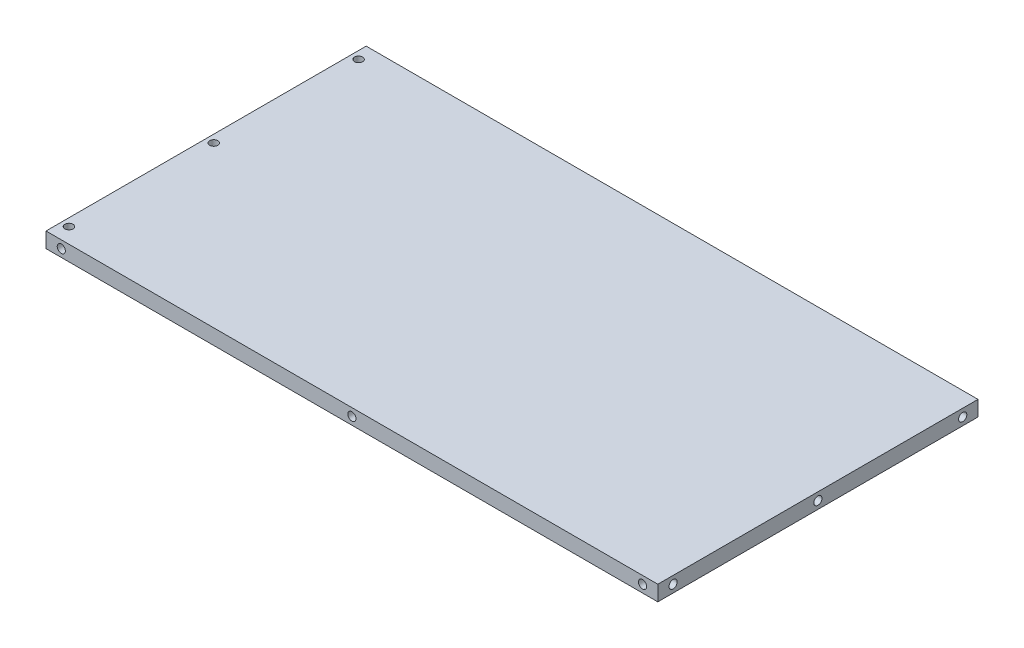
ISO-10303-21;
HEADER;
FILE_DESCRIPTION(('STEP AP214'),'2;1');
FILE_NAME('part.step','',(''),(''),'','','');
FILE_SCHEMA(('AUTOMOTIVE_DESIGN { 1 0 10303 214 1 1 1 1 }'));
ENDSEC;
DATA;
#1=APPLICATION_CONTEXT('core data for automotive mechanical design processes');
#2=APPLICATION_PROTOCOL_DEFINITION('international standard','automotive_design',2000,#1);
#3=PRODUCT_CONTEXT('',#1,'mechanical');
#4=PRODUCT('Part','Part','',(#3));
#5=PRODUCT_RELATED_PRODUCT_CATEGORY('part','',(#4));
#6=PRODUCT_DEFINITION_FORMATION('','',#4);
#7=PRODUCT_DEFINITION_CONTEXT('part definition',#1,'design');
#8=PRODUCT_DEFINITION('design','',#6,#7);
#9=PRODUCT_DEFINITION_SHAPE('','',#8);
#10=(LENGTH_UNIT() NAMED_UNIT(*) SI_UNIT(.MILLI.,.METRE.));
#11=(NAMED_UNIT(*) PLANE_ANGLE_UNIT() SI_UNIT($,.RADIAN.));
#12=(NAMED_UNIT(*) SI_UNIT($,.STERADIAN.) SOLID_ANGLE_UNIT());
#13=UNCERTAINTY_MEASURE_WITH_UNIT(LENGTH_MEASURE(1.E-05),#10,'distance_accuracy_value','');
#14=(GEOMETRIC_REPRESENTATION_CONTEXT(3) GLOBAL_UNCERTAINTY_ASSIGNED_CONTEXT((#13)) GLOBAL_UNIT_ASSIGNED_CONTEXT((#10,
#11,#12)) REPRESENTATION_CONTEXT('',''));
#15=CARTESIAN_POINT('',(0.,0.,0.));
#16=DIRECTION('',(0.,0.,1.));
#17=DIRECTION('',(1.,0.,0.));
#18=AXIS2_PLACEMENT_3D('',#15,#16,#17);
#19=CARTESIAN_POINT('',(300.,15.,157.));
#20=DIRECTION('',(-1.,0.,0.));
#21=DIRECTION('',(0.,0.,1.));
#22=AXIS2_PLACEMENT_3D('',#19,#20,#21);
#23=PLANE('',#22);
#24=CARTESIAN_POINT('',(300.,7.5,-142.));
#25=DIRECTION('',(1.,0.,0.));
#26=DIRECTION('',(0.,0.,-1.));
#27=AXIS2_PLACEMENT_3D('',#24,#25,#26);
#28=CIRCLE('',#27,3.99999999999999);
#29=CARTESIAN_POINT('',(300.,7.5,-146.));
#30=VERTEX_POINT('',#29);
#31=EDGE_CURVE('E166',#30,#30,#28,.T.);
#32=ORIENTED_EDGE('',*,*,#31,.F.);
#33=EDGE_LOOP('',(#32));
#34=FACE_BOUND('',#33,.T.);
#35=CARTESIAN_POINT('',(300.,7.5,0.));
#36=DIRECTION('',(1.,0.,0.));
#37=DIRECTION('',(0.,0.,-1.));
#38=AXIS2_PLACEMENT_3D('',#35,#36,#37);
#39=CIRCLE('',#38,3.99999999999999);
#40=CARTESIAN_POINT('',(300.,7.5,-4.00000000000002));
#41=VERTEX_POINT('',#40);
#42=EDGE_CURVE('E160',#41,#41,#39,.T.);
#43=ORIENTED_EDGE('',*,*,#42,.F.);
#44=EDGE_LOOP('',(#43));
#45=FACE_BOUND('',#44,.T.);
#46=CARTESIAN_POINT('',(300.,7.5,142.));
#47=DIRECTION('',(1.,0.,0.));
#48=DIRECTION('',(0.,0.,-1.));
#49=AXIS2_PLACEMENT_3D('',#46,#47,#48);
#50=CIRCLE('',#49,3.99999999999999);
#51=CARTESIAN_POINT('',(300.,7.5,138.));
#52=VERTEX_POINT('',#51);
#53=EDGE_CURVE('E152',#52,#52,#50,.T.);
#54=ORIENTED_EDGE('',*,*,#53,.F.);
#55=EDGE_LOOP('',(#54));
#56=FACE_BOUND('',#55,.T.);
#57=DIRECTION('',(0.,0.,-1.));
#58=VECTOR('',#57,1.);
#59=CARTESIAN_POINT('',(300.,0.,157.));
#60=LINE('',#59,#58);
#61=CARTESIAN_POINT('',(300.,0.,157.));
#62=VERTEX_POINT('',#61);
#63=CARTESIAN_POINT('',(300.,0.,-157.));
#64=VERTEX_POINT('',#63);
#65=EDGE_CURVE('E102',#62,#64,#60,.T.);
#66=ORIENTED_EDGE('',*,*,#65,.T.);
#67=DIRECTION('',(0.,-1.,0.));
#68=VECTOR('',#67,1.);
#69=CARTESIAN_POINT('',(300.,15.,-157.));
#70=LINE('',#69,#68);
#71=CARTESIAN_POINT('',(300.,15.,-157.));
#72=VERTEX_POINT('',#71);
#73=EDGE_CURVE('E11',#72,#64,#70,.T.);
#74=ORIENTED_EDGE('',*,*,#73,.F.);
#75=DIRECTION('',(0.,0.,-1.));
#76=VECTOR('',#75,1.);
#77=CARTESIAN_POINT('',(300.,15.,157.));
#78=LINE('',#77,#76);
#79=CARTESIAN_POINT('',(300.,15.,157.));
#80=VERTEX_POINT('',#79);
#81=EDGE_CURVE('E90',#80,#72,#78,.T.);
#82=ORIENTED_EDGE('',*,*,#81,.F.);
#83=DIRECTION('',(0.,-1.,0.));
#84=VECTOR('',#83,1.);
#85=CARTESIAN_POINT('',(300.,15.,157.));
#86=LINE('',#85,#84);
#87=EDGE_CURVE('E98',#80,#62,#86,.T.);
#88=ORIENTED_EDGE('',*,*,#87,.T.);
#89=EDGE_LOOP('',(#66,#74,#82,#88));
#90=FACE_BOUND('',#89,.T.);
#91=ADVANCED_FACE('F39',(#34,#45,#56,#90),#23,.F.);
#92=CARTESIAN_POINT('',(-300.,15.,-157.));
#93=DIRECTION('',(0.,0.,1.));
#94=DIRECTION('',(1.,0.,0.));
#95=AXIS2_PLACEMENT_3D('',#92,#93,#94);
#96=PLANE('',#95);
#97=CARTESIAN_POINT('',(0.,7.5,-157.));
#98=DIRECTION('',(0.,0.,1.));
#99=DIRECTION('',(1.,0.,0.));
#100=AXIS2_PLACEMENT_3D('',#97,#98,#99);
#101=CIRCLE('',#100,3.99999999999999);
#102=CARTESIAN_POINT('',(3.99999999999994,7.5,-157.));
#103=VERTEX_POINT('',#102);
#104=EDGE_CURVE('E182',#103,#103,#101,.T.);
#105=ORIENTED_EDGE('',*,*,#104,.T.);
#106=EDGE_LOOP('',(#105));
#107=FACE_BOUND('',#106,.T.);
#108=CARTESIAN_POINT('',(285.,7.5,-157.));
#109=DIRECTION('',(0.,0.,1.));
#110=DIRECTION('',(1.,0.,0.));
#111=AXIS2_PLACEMENT_3D('',#108,#109,#110);
#112=CIRCLE('',#111,3.99999999999999);
#113=CARTESIAN_POINT('',(289.,7.5,-157.));
#114=VERTEX_POINT('',#113);
#115=EDGE_CURVE('E176',#114,#114,#112,.T.);
#116=ORIENTED_EDGE('',*,*,#115,.T.);
#117=EDGE_LOOP('',(#116));
#118=FACE_BOUND('',#117,.T.);
#119=CARTESIAN_POINT('',(-285.,7.5,-157.));
#120=DIRECTION('',(0.,0.,1.));
#121=DIRECTION('',(1.,0.,0.));
#122=AXIS2_PLACEMENT_3D('',#119,#120,#121);
#123=CIRCLE('',#122,3.99999999999999);
#124=CARTESIAN_POINT('',(-281.,7.5,-157.));
#125=VERTEX_POINT('',#124);
#126=EDGE_CURVE('E170',#125,#125,#123,.T.);
#127=ORIENTED_EDGE('',*,*,#126,.T.);
#128=EDGE_LOOP('',(#127));
#129=FACE_BOUND('',#128,.T.);
#130=DIRECTION('',(-1.,0.,0.));
#131=VECTOR('',#130,1.);
#132=CARTESIAN_POINT('',(-300.,0.,-157.));
#133=LINE('',#132,#131);
#134=CARTESIAN_POINT('',(-300.,0.,-157.));
#135=VERTEX_POINT('',#134);
#136=EDGE_CURVE('E94',#64,#135,#133,.T.);
#137=ORIENTED_EDGE('',*,*,#136,.T.);
#138=DIRECTION('',(0.,-1.,0.));
#139=VECTOR('',#138,1.);
#140=CARTESIAN_POINT('',(-300.,15.,-157.));
#141=LINE('',#140,#139);
#142=CARTESIAN_POINT('',(-300.,15.,-157.));
#143=VERTEX_POINT('',#142);
#144=EDGE_CURVE('E47',#143,#135,#141,.T.);
#145=ORIENTED_EDGE('',*,*,#144,.F.);
#146=DIRECTION('',(-1.,0.,0.));
#147=VECTOR('',#146,1.);
#148=CARTESIAN_POINT('',(-300.,15.,-157.));
#149=LINE('',#148,#147);
#150=EDGE_CURVE('E85',#72,#143,#149,.T.);
#151=ORIENTED_EDGE('',*,*,#150,.F.);
#152=ORIENTED_EDGE('',*,*,#73,.T.);
#153=EDGE_LOOP('',(#137,#145,#151,#152));
#154=FACE_BOUND('',#153,.T.);
#155=ADVANCED_FACE('F93',(#107,#118,#129,#154),#96,.F.);
#156=CARTESIAN_POINT('',(-300.,15.,157.));
#157=DIRECTION('',(1.,0.,0.));
#158=DIRECTION('',(0.,0.,-1.));
#159=AXIS2_PLACEMENT_3D('',#156,#157,#158);
#160=PLANE('',#159);
#161=DIRECTION('',(0.,0.,1.));
#162=VECTOR('',#161,1.);
#163=CARTESIAN_POINT('',(-300.,0.,157.));
#164=LINE('',#163,#162);
#165=CARTESIAN_POINT('',(-300.,0.,157.));
#166=VERTEX_POINT('',#165);
#167=EDGE_CURVE('E72',#135,#166,#164,.T.);
#168=ORIENTED_EDGE('',*,*,#167,.T.);
#169=DIRECTION('',(0.,-1.,0.));
#170=VECTOR('',#169,1.);
#171=CARTESIAN_POINT('',(-300.,15.,157.));
#172=LINE('',#171,#170);
#173=CARTESIAN_POINT('',(-300.,15.,157.));
#174=VERTEX_POINT('',#173);
#175=EDGE_CURVE('E95',#174,#166,#172,.T.);
#176=ORIENTED_EDGE('',*,*,#175,.F.);
#177=DIRECTION('',(0.,0.,1.));
#178=VECTOR('',#177,1.);
#179=CARTESIAN_POINT('',(-300.,15.,157.));
#180=LINE('',#179,#178);
#181=EDGE_CURVE('E88',#143,#174,#180,.T.);
#182=ORIENTED_EDGE('',*,*,#181,.F.);
#183=ORIENTED_EDGE('',*,*,#144,.T.);
#184=EDGE_LOOP('',(#168,#176,#182,#183));
#185=FACE_BOUND('',#184,.T.);
#186=ADVANCED_FACE('F96',(#185),#160,.F.);
#187=CARTESIAN_POINT('',(-300.,15.,157.));
#188=DIRECTION('',(0.,0.,-1.));
#189=DIRECTION('',(-1.,0.,0.));
#190=AXIS2_PLACEMENT_3D('',#187,#188,#189);
#191=PLANE('',#190);
#192=CARTESIAN_POINT('',(285.,7.5,157.));
#193=DIRECTION('',(0.,0.,1.));
#194=DIRECTION('',(1.,0.,0.));
#195=AXIS2_PLACEMENT_3D('',#192,#193,#194);
#196=CIRCLE('',#195,3.99999999999999);
#197=CARTESIAN_POINT('',(289.,7.5,157.));
#198=VERTEX_POINT('',#197);
#199=EDGE_CURVE('E148',#198,#198,#196,.T.);
#200=ORIENTED_EDGE('',*,*,#199,.F.);
#201=EDGE_LOOP('',(#200));
#202=FACE_BOUND('',#201,.T.);
#203=CARTESIAN_POINT('',(0.,7.5,157.));
#204=DIRECTION('',(0.,0.,1.));
#205=DIRECTION('',(1.,0.,0.));
#206=AXIS2_PLACEMENT_3D('',#203,#204,#205);
#207=CIRCLE('',#206,3.99999999999999);
#208=CARTESIAN_POINT('',(3.99999999999994,7.5,157.));
#209=VERTEX_POINT('',#208);
#210=EDGE_CURVE('E142',#209,#209,#207,.T.);
#211=ORIENTED_EDGE('',*,*,#210,.F.);
#212=EDGE_LOOP('',(#211));
#213=FACE_BOUND('',#212,.T.);
#214=CARTESIAN_POINT('',(-285.,7.5,157.));
#215=DIRECTION('',(0.,0.,1.));
#216=DIRECTION('',(1.,0.,0.));
#217=AXIS2_PLACEMENT_3D('',#214,#215,#216);
#218=CIRCLE('',#217,3.99999999999999);
#219=CARTESIAN_POINT('',(-281.,7.5,157.));
#220=VERTEX_POINT('',#219);
#221=EDGE_CURVE('E134',#220,#220,#218,.T.);
#222=ORIENTED_EDGE('',*,*,#221,.F.);
#223=EDGE_LOOP('',(#222));
#224=FACE_BOUND('',#223,.T.);
#225=DIRECTION('',(1.,0.,0.));
#226=VECTOR('',#225,1.);
#227=CARTESIAN_POINT('',(-300.,0.,157.));
#228=LINE('',#227,#226);
#229=EDGE_CURVE('E78',#166,#62,#228,.T.);
#230=ORIENTED_EDGE('',*,*,#229,.T.);
#231=ORIENTED_EDGE('',*,*,#87,.F.);
#232=DIRECTION('',(1.,0.,0.));
#233=VECTOR('',#232,1.);
#234=CARTESIAN_POINT('',(-300.,15.,157.));
#235=LINE('',#234,#233);
#236=EDGE_CURVE('E55',#174,#80,#235,.T.);
#237=ORIENTED_EDGE('',*,*,#236,.F.);
#238=ORIENTED_EDGE('',*,*,#175,.T.);
#239=EDGE_LOOP('',(#230,#231,#237,#238));
#240=FACE_BOUND('',#239,.T.);
#241=ADVANCED_FACE('F110',(#202,#213,#224,#240),#191,.F.);
#242=CARTESIAN_POINT('',(0.,15.,0.));
#243=DIRECTION('',(0.,-1.,0.));
#244=DIRECTION('',(0.,0.,-1.));
#245=AXIS2_PLACEMENT_3D('',#242,#243,#244);
#246=PLANE('',#245);
#247=CARTESIAN_POINT('',(-292.5,15.,142.));
#248=DIRECTION('',(0.,1.,0.));
#249=DIRECTION('',(0.,0.,1.));
#250=AXIS2_PLACEMENT_3D('',#247,#248,#249);
#251=CIRCLE('',#250,3.99999999999999);
#252=CARTESIAN_POINT('',(-292.5,15.,146.));
#253=VERTEX_POINT('',#252);
#254=EDGE_CURVE('E130',#253,#253,#251,.T.);
#255=ORIENTED_EDGE('',*,*,#254,.F.);
#256=EDGE_LOOP('',(#255));
#257=FACE_BOUND('',#256,.T.);
#258=CARTESIAN_POINT('',(-292.5,15.,0.));
#259=DIRECTION('',(0.,1.,0.));
#260=DIRECTION('',(0.,0.,1.));
#261=AXIS2_PLACEMENT_3D('',#258,#259,#260);
#262=CIRCLE('',#261,3.99999999999999);
#263=CARTESIAN_POINT('',(-292.5,15.,3.99999999999997));
#264=VERTEX_POINT('',#263);
#265=EDGE_CURVE('E124',#264,#264,#262,.T.);
#266=ORIENTED_EDGE('',*,*,#265,.F.);
#267=EDGE_LOOP('',(#266));
#268=FACE_BOUND('',#267,.T.);
#269=CARTESIAN_POINT('',(-292.5,15.,-142.));
#270=DIRECTION('',(0.,1.,0.));
#271=DIRECTION('',(0.,0.,1.));
#272=AXIS2_PLACEMENT_3D('',#269,#270,#271);
#273=CIRCLE('',#272,3.99999999999999);
#274=CARTESIAN_POINT('',(-292.5,15.,-138.));
#275=VERTEX_POINT('',#274);
#276=EDGE_CURVE('E116',#275,#275,#273,.T.);
#277=ORIENTED_EDGE('',*,*,#276,.F.);
#278=EDGE_LOOP('',(#277));
#279=FACE_BOUND('',#278,.T.);
#280=ORIENTED_EDGE('',*,*,#81,.T.);
#281=ORIENTED_EDGE('',*,*,#150,.T.);
#282=ORIENTED_EDGE('',*,*,#181,.T.);
#283=ORIENTED_EDGE('',*,*,#236,.T.);
#284=EDGE_LOOP('',(#280,#281,#282,#283));
#285=FACE_BOUND('',#284,.T.);
#286=ADVANCED_FACE('F86',(#257,#268,#279,#285),#246,.F.);
#287=CARTESIAN_POINT('',(0.,0.,0.));
#288=DIRECTION('',(0.,-1.,0.));
#289=DIRECTION('',(0.,0.,-1.));
#290=AXIS2_PLACEMENT_3D('',#287,#288,#289);
#291=PLANE('',#290);
#292=ORIENTED_EDGE('',*,*,#65,.F.);
#293=ORIENTED_EDGE('',*,*,#229,.F.);
#294=ORIENTED_EDGE('',*,*,#167,.F.);
#295=ORIENTED_EDGE('',*,*,#136,.F.);
#296=EDGE_LOOP('',(#292,#293,#294,#295));
#297=FACE_BOUND('',#296,.T.);
#298=ADVANCED_FACE('F113',(#297),#291,.T.);
#299=CARTESIAN_POINT('',(-292.5,5.,-142.));
#300=DIRECTION('',(0.,1.,0.));
#301=DIRECTION('',(0.,0.,1.));
#302=AXIS2_PLACEMENT_3D('',#299,#300,#301);
#303=CYLINDRICAL_SURFACE('',#302,3.99999999999999);
#304=CARTESIAN_POINT('',(-292.5,5.,-142.));
#305=DIRECTION('',(0.,1.,0.));
#306=DIRECTION('',(0.,0.,1.));
#307=AXIS2_PLACEMENT_3D('',#304,#305,#306);
#308=CIRCLE('',#307,3.99999999999999);
#309=CARTESIAN_POINT('',(-292.5,5.,-138.));
#310=VERTEX_POINT('',#309);
#311=EDGE_CURVE('E105',#310,#310,#308,.T.);
#312=ORIENTED_EDGE('',*,*,#311,.F.);
#313=EDGE_LOOP('',(#312));
#314=FACE_BOUND('',#313,.T.);
#315=ORIENTED_EDGE('',*,*,#276,.T.);
#316=EDGE_LOOP('',(#315));
#317=FACE_BOUND('',#316,.T.);
#318=ADVANCED_FACE('F269',(#314,#317),#303,.F.);
#319=CARTESIAN_POINT('',(-292.5,5.,-142.));
#320=DIRECTION('',(0.,1.,0.));
#321=DIRECTION('',(0.,0.,1.));
#322=AXIS2_PLACEMENT_3D('',#319,#320,#321);
#323=PLANE('',#322);
#324=ORIENTED_EDGE('',*,*,#311,.T.);
#325=EDGE_LOOP('',(#324));
#326=FACE_BOUND('',#325,.T.);
#327=ADVANCED_FACE('F265',(#326),#323,.T.);
#328=CARTESIAN_POINT('',(-292.5,5.,0.));
#329=DIRECTION('',(0.,1.,0.));
#330=DIRECTION('',(0.,0.,1.));
#331=AXIS2_PLACEMENT_3D('',#328,#329,#330);
#332=CYLINDRICAL_SURFACE('',#331,3.99999999999999);
#333=CARTESIAN_POINT('',(-292.5,5.,0.));
#334=DIRECTION('',(0.,1.,0.));
#335=DIRECTION('',(0.,0.,1.));
#336=AXIS2_PLACEMENT_3D('',#333,#334,#335);
#337=CIRCLE('',#336,3.99999999999999);
#338=CARTESIAN_POINT('',(-292.5,5.,3.99999999999997));
#339=VERTEX_POINT('',#338);
#340=EDGE_CURVE('E119',#339,#339,#337,.T.);
#341=ORIENTED_EDGE('',*,*,#340,.F.);
#342=EDGE_LOOP('',(#341));
#343=FACE_BOUND('',#342,.T.);
#344=ORIENTED_EDGE('',*,*,#265,.T.);
#345=EDGE_LOOP('',(#344));
#346=FACE_BOUND('',#345,.T.);
#347=ADVANCED_FACE('F261',(#343,#346),#332,.F.);
#348=CARTESIAN_POINT('',(-292.5,5.,0.));
#349=DIRECTION('',(0.,1.,0.));
#350=DIRECTION('',(0.,0.,1.));
#351=AXIS2_PLACEMENT_3D('',#348,#349,#350);
#352=PLANE('',#351);
#353=ORIENTED_EDGE('',*,*,#340,.T.);
#354=EDGE_LOOP('',(#353));
#355=FACE_BOUND('',#354,.T.);
#356=ADVANCED_FACE('F257',(#355),#352,.T.);
#357=CARTESIAN_POINT('',(-292.5,5.,142.));
#358=DIRECTION('',(0.,1.,0.));
#359=DIRECTION('',(0.,0.,1.));
#360=AXIS2_PLACEMENT_3D('',#357,#358,#359);
#361=CYLINDRICAL_SURFACE('',#360,3.99999999999999);
#362=CARTESIAN_POINT('',(-292.5,5.,142.));
#363=DIRECTION('',(0.,1.,0.));
#364=DIRECTION('',(0.,0.,1.));
#365=AXIS2_PLACEMENT_3D('',#362,#363,#364);
#366=CIRCLE('',#365,3.99999999999999);
#367=CARTESIAN_POINT('',(-292.5,5.,146.));
#368=VERTEX_POINT('',#367);
#369=EDGE_CURVE('E127',#368,#368,#366,.T.);
#370=ORIENTED_EDGE('',*,*,#369,.F.);
#371=EDGE_LOOP('',(#370));
#372=FACE_BOUND('',#371,.T.);
#373=ORIENTED_EDGE('',*,*,#254,.T.);
#374=EDGE_LOOP('',(#373));
#375=FACE_BOUND('',#374,.T.);
#376=ADVANCED_FACE('F253',(#372,#375),#361,.F.);
#377=CARTESIAN_POINT('',(-292.5,5.,142.));
#378=DIRECTION('',(0.,1.,0.));
#379=DIRECTION('',(0.,0.,1.));
#380=AXIS2_PLACEMENT_3D('',#377,#378,#379);
#381=PLANE('',#380);
#382=ORIENTED_EDGE('',*,*,#369,.T.);
#383=EDGE_LOOP('',(#382));
#384=FACE_BOUND('',#383,.T.);
#385=ADVANCED_FACE('F249',(#384),#381,.T.);
#386=CARTESIAN_POINT('',(-285.,7.5,147.));
#387=DIRECTION('',(0.,0.,1.));
#388=DIRECTION('',(1.,0.,0.));
#389=AXIS2_PLACEMENT_3D('',#386,#387,#388);
#390=CYLINDRICAL_SURFACE('',#389,3.99999999999999);
#391=CARTESIAN_POINT('',(-285.,7.5,147.));
#392=DIRECTION('',(0.,0.,1.));
#393=DIRECTION('',(1.,0.,0.));
#394=AXIS2_PLACEMENT_3D('',#391,#392,#393);
#395=CIRCLE('',#394,3.99999999999999);
#396=CARTESIAN_POINT('',(-281.,7.5,147.));
#397=VERTEX_POINT('',#396);
#398=EDGE_CURVE('E133',#397,#397,#395,.T.);
#399=ORIENTED_EDGE('',*,*,#398,.F.);
#400=EDGE_LOOP('',(#399));
#401=FACE_BOUND('',#400,.T.);
#402=ORIENTED_EDGE('',*,*,#221,.T.);
#403=EDGE_LOOP('',(#402));
#404=FACE_BOUND('',#403,.T.);
#405=ADVANCED_FACE('F245',(#401,#404),#390,.F.);
#406=CARTESIAN_POINT('',(-285.,7.5,147.));
#407=DIRECTION('',(0.,0.,1.));
#408=DIRECTION('',(1.,0.,0.));
#409=AXIS2_PLACEMENT_3D('',#406,#407,#408);
#410=PLANE('',#409);
#411=ORIENTED_EDGE('',*,*,#398,.T.);
#412=EDGE_LOOP('',(#411));
#413=FACE_BOUND('',#412,.T.);
#414=ADVANCED_FACE('F241',(#413),#410,.T.);
#415=CARTESIAN_POINT('',(0.,7.5,147.));
#416=DIRECTION('',(0.,0.,1.));
#417=DIRECTION('',(1.,0.,0.));
#418=AXIS2_PLACEMENT_3D('',#415,#416,#417);
#419=CYLINDRICAL_SURFACE('',#418,3.99999999999999);
#420=CARTESIAN_POINT('',(0.,7.5,147.));
#421=DIRECTION('',(0.,0.,1.));
#422=DIRECTION('',(1.,0.,0.));
#423=AXIS2_PLACEMENT_3D('',#420,#421,#422);
#424=CIRCLE('',#423,3.99999999999999);
#425=CARTESIAN_POINT('',(3.99999999999994,7.5,147.));
#426=VERTEX_POINT('',#425);
#427=EDGE_CURVE('E137',#426,#426,#424,.T.);
#428=ORIENTED_EDGE('',*,*,#427,.F.);
#429=EDGE_LOOP('',(#428));
#430=FACE_BOUND('',#429,.T.);
#431=ORIENTED_EDGE('',*,*,#210,.T.);
#432=EDGE_LOOP('',(#431));
#433=FACE_BOUND('',#432,.T.);
#434=ADVANCED_FACE('F237',(#430,#433),#419,.F.);
#435=CARTESIAN_POINT('',(0.,7.5,147.));
#436=DIRECTION('',(0.,0.,1.));
#437=DIRECTION('',(1.,0.,0.));
#438=AXIS2_PLACEMENT_3D('',#435,#436,#437);
#439=PLANE('',#438);
#440=ORIENTED_EDGE('',*,*,#427,.T.);
#441=EDGE_LOOP('',(#440));
#442=FACE_BOUND('',#441,.T.);
#443=ADVANCED_FACE('F233',(#442),#439,.T.);
#444=CARTESIAN_POINT('',(285.,7.5,147.));
#445=DIRECTION('',(0.,0.,1.));
#446=DIRECTION('',(1.,0.,0.));
#447=AXIS2_PLACEMENT_3D('',#444,#445,#446);
#448=CYLINDRICAL_SURFACE('',#447,3.99999999999999);
#449=CARTESIAN_POINT('',(285.,7.5,147.));
#450=DIRECTION('',(0.,0.,1.));
#451=DIRECTION('',(1.,0.,0.));
#452=AXIS2_PLACEMENT_3D('',#449,#450,#451);
#453=CIRCLE('',#452,3.99999999999999);
#454=CARTESIAN_POINT('',(289.,7.5,147.));
#455=VERTEX_POINT('',#454);
#456=EDGE_CURVE('E145',#455,#455,#453,.T.);
#457=ORIENTED_EDGE('',*,*,#456,.F.);
#458=EDGE_LOOP('',(#457));
#459=FACE_BOUND('',#458,.T.);
#460=ORIENTED_EDGE('',*,*,#199,.T.);
#461=EDGE_LOOP('',(#460));
#462=FACE_BOUND('',#461,.T.);
#463=ADVANCED_FACE('F225',(#459,#462),#448,.F.);
#464=CARTESIAN_POINT('',(285.,7.5,147.));
#465=DIRECTION('',(0.,0.,1.));
#466=DIRECTION('',(1.,0.,0.));
#467=AXIS2_PLACEMENT_3D('',#464,#465,#466);
#468=PLANE('',#467);
#469=ORIENTED_EDGE('',*,*,#456,.T.);
#470=EDGE_LOOP('',(#469));
#471=FACE_BOUND('',#470,.T.);
#472=ADVANCED_FACE('F215',(#471),#468,.T.);
#473=CARTESIAN_POINT('',(290.,7.5,142.));
#474=DIRECTION('',(1.,0.,0.));
#475=DIRECTION('',(0.,0.,-1.));
#476=AXIS2_PLACEMENT_3D('',#473,#474,#475);
#477=CYLINDRICAL_SURFACE('',#476,3.99999999999999);
#478=CARTESIAN_POINT('',(290.,7.5,142.));
#479=DIRECTION('',(1.,0.,0.));
#480=DIRECTION('',(0.,0.,-1.));
#481=AXIS2_PLACEMENT_3D('',#478,#479,#480);
#482=CIRCLE('',#481,3.99999999999999);
#483=CARTESIAN_POINT('',(290.,7.5,138.));
#484=VERTEX_POINT('',#483);
#485=EDGE_CURVE('E151',#484,#484,#482,.T.);
#486=ORIENTED_EDGE('',*,*,#485,.F.);
#487=EDGE_LOOP('',(#486));
#488=FACE_BOUND('',#487,.T.);
#489=ORIENTED_EDGE('',*,*,#53,.T.);
#490=EDGE_LOOP('',(#489));
#491=FACE_BOUND('',#490,.T.);
#492=ADVANCED_FACE('F212',(#488,#491),#477,.F.);
#493=CARTESIAN_POINT('',(290.,7.5,142.));
#494=DIRECTION('',(1.,0.,0.));
#495=DIRECTION('',(0.,0.,-1.));
#496=AXIS2_PLACEMENT_3D('',#493,#494,#495);
#497=PLANE('',#496);
#498=ORIENTED_EDGE('',*,*,#485,.T.);
#499=EDGE_LOOP('',(#498));
#500=FACE_BOUND('',#499,.T.);
#501=ADVANCED_FACE('F214',(#500),#497,.T.);
#502=CARTESIAN_POINT('',(290.,7.5,0.));
#503=DIRECTION('',(1.,0.,0.));
#504=DIRECTION('',(0.,0.,-1.));
#505=AXIS2_PLACEMENT_3D('',#502,#503,#504);
#506=CYLINDRICAL_SURFACE('',#505,3.99999999999999);
#507=CARTESIAN_POINT('',(290.,7.5,0.));
#508=DIRECTION('',(1.,0.,0.));
#509=DIRECTION('',(0.,0.,-1.));
#510=AXIS2_PLACEMENT_3D('',#507,#508,#509);
#511=CIRCLE('',#510,3.99999999999999);
#512=CARTESIAN_POINT('',(290.,7.5,-4.00000000000002));
#513=VERTEX_POINT('',#512);
#514=EDGE_CURVE('E155',#513,#513,#511,.T.);
#515=ORIENTED_EDGE('',*,*,#514,.F.);
#516=EDGE_LOOP('',(#515));
#517=FACE_BOUND('',#516,.T.);
#518=ORIENTED_EDGE('',*,*,#42,.T.);
#519=EDGE_LOOP('',(#518));
#520=FACE_BOUND('',#519,.T.);
#521=ADVANCED_FACE('F222',(#517,#520),#506,.F.);
#522=CARTESIAN_POINT('',(290.,7.5,0.));
#523=DIRECTION('',(1.,0.,0.));
#524=DIRECTION('',(0.,0.,-1.));
#525=AXIS2_PLACEMENT_3D('',#522,#523,#524);
#526=PLANE('',#525);
#527=ORIENTED_EDGE('',*,*,#514,.T.);
#528=EDGE_LOOP('',(#527));
#529=FACE_BOUND('',#528,.T.);
#530=ADVANCED_FACE('F374',(#529),#526,.T.);
#531=CARTESIAN_POINT('',(290.,7.5,-142.));
#532=DIRECTION('',(1.,0.,0.));
#533=DIRECTION('',(0.,0.,-1.));
#534=AXIS2_PLACEMENT_3D('',#531,#532,#533);
#535=CYLINDRICAL_SURFACE('',#534,3.99999999999999);
#536=CARTESIAN_POINT('',(290.,7.5,-142.));
#537=DIRECTION('',(1.,0.,0.));
#538=DIRECTION('',(0.,0.,-1.));
#539=AXIS2_PLACEMENT_3D('',#536,#537,#538);
#540=CIRCLE('',#539,3.99999999999999);
#541=CARTESIAN_POINT('',(290.,7.5,-146.));
#542=VERTEX_POINT('',#541);
#543=EDGE_CURVE('E163',#542,#542,#540,.T.);
#544=ORIENTED_EDGE('',*,*,#543,.F.);
#545=EDGE_LOOP('',(#544));
#546=FACE_BOUND('',#545,.T.);
#547=ORIENTED_EDGE('',*,*,#31,.T.);
#548=EDGE_LOOP('',(#547));
#549=FACE_BOUND('',#548,.T.);
#550=ADVANCED_FACE('F384',(#546,#549),#535,.F.);
#551=CARTESIAN_POINT('',(290.,7.5,-142.));
#552=DIRECTION('',(1.,0.,0.));
#553=DIRECTION('',(0.,0.,-1.));
#554=AXIS2_PLACEMENT_3D('',#551,#552,#553);
#555=PLANE('',#554);
#556=ORIENTED_EDGE('',*,*,#543,.T.);
#557=EDGE_LOOP('',(#556));
#558=FACE_BOUND('',#557,.T.);
#559=ADVANCED_FACE('F395',(#558),#555,.T.);
#560=CARTESIAN_POINT('',(-285.,7.5,-147.));
#561=DIRECTION('',(0.,0.,-1.));
#562=DIRECTION('',(-1.,0.,0.));
#563=AXIS2_PLACEMENT_3D('',#560,#561,#562);
#564=CYLINDRICAL_SURFACE('',#563,3.99999999999999);
#565=CARTESIAN_POINT('',(-285.,7.5,-147.));
#566=DIRECTION('',(0.,0.,1.));
#567=DIRECTION('',(1.,0.,0.));
#568=AXIS2_PLACEMENT_3D('',#565,#566,#567);
#569=CIRCLE('',#568,3.99999999999999);
#570=CARTESIAN_POINT('',(-281.,7.5,-147.));
#571=VERTEX_POINT('',#570);
#572=EDGE_CURVE('E169',#571,#571,#569,.T.);
#573=ORIENTED_EDGE('',*,*,#572,.T.);
#574=EDGE_LOOP('',(#573));
#575=FACE_BOUND('',#574,.T.);
#576=ORIENTED_EDGE('',*,*,#126,.F.);
#577=EDGE_LOOP('',(#576));
#578=FACE_BOUND('',#577,.T.);
#579=ADVANCED_FACE('F405',(#575,#578),#564,.F.);
#580=CARTESIAN_POINT('',(-285.,7.5,-147.));
#581=DIRECTION('',(0.,0.,-1.));
#582=DIRECTION('',(1.,0.,0.));
#583=AXIS2_PLACEMENT_3D('',#580,#581,#582);
#584=PLANE('',#583);
#585=ORIENTED_EDGE('',*,*,#572,.F.);
#586=EDGE_LOOP('',(#585));
#587=FACE_BOUND('',#586,.T.);
#588=ADVANCED_FACE('F418',(#587),#584,.T.);
#589=CARTESIAN_POINT('',(285.,7.5,-147.));
#590=DIRECTION('',(0.,0.,-1.));
#591=DIRECTION('',(-1.,0.,0.));
#592=AXIS2_PLACEMENT_3D('',#589,#590,#591);
#593=CYLINDRICAL_SURFACE('',#592,3.99999999999999);
#594=CARTESIAN_POINT('',(285.,7.5,-147.));
#595=DIRECTION('',(0.,0.,1.));
#596=DIRECTION('',(1.,0.,0.));
#597=AXIS2_PLACEMENT_3D('',#594,#595,#596);
#598=CIRCLE('',#597,3.99999999999999);
#599=CARTESIAN_POINT('',(289.,7.5,-147.));
#600=VERTEX_POINT('',#599);
#601=EDGE_CURVE('E179',#600,#600,#598,.T.);
#602=ORIENTED_EDGE('',*,*,#601,.T.);
#603=EDGE_LOOP('',(#602));
#604=FACE_BOUND('',#603,.T.);
#605=ORIENTED_EDGE('',*,*,#115,.F.);
#606=EDGE_LOOP('',(#605));
#607=FACE_BOUND('',#606,.T.);
#608=ADVANCED_FACE('F429',(#604,#607),#593,.F.);
#609=CARTESIAN_POINT('',(285.,7.5,-147.));
#610=DIRECTION('',(0.,0.,-1.));
#611=DIRECTION('',(1.,0.,0.));
#612=AXIS2_PLACEMENT_3D('',#609,#610,#611);
#613=PLANE('',#612);
#614=ORIENTED_EDGE('',*,*,#601,.F.);
#615=EDGE_LOOP('',(#614));
#616=FACE_BOUND('',#615,.T.);
#617=ADVANCED_FACE('F197',(#616),#613,.T.);
#618=CARTESIAN_POINT('',(0.,7.5,-147.));
#619=DIRECTION('',(0.,0.,-1.));
#620=DIRECTION('',(-1.,0.,0.));
#621=AXIS2_PLACEMENT_3D('',#618,#619,#620);
#622=CYLINDRICAL_SURFACE('',#621,3.99999999999999);
#623=CARTESIAN_POINT('',(0.,7.5,-147.));
#624=DIRECTION('',(0.,0.,1.));
#625=DIRECTION('',(1.,0.,0.));
#626=AXIS2_PLACEMENT_3D('',#623,#624,#625);
#627=CIRCLE('',#626,3.99999999999999);
#628=CARTESIAN_POINT('',(3.99999999999994,7.5,-147.));
#629=VERTEX_POINT('',#628);
#630=EDGE_CURVE('E173',#629,#629,#627,.T.);
#631=ORIENTED_EDGE('',*,*,#630,.T.);
#632=EDGE_LOOP('',(#631));
#633=FACE_BOUND('',#632,.T.);
#634=ORIENTED_EDGE('',*,*,#104,.F.);
#635=EDGE_LOOP('',(#634));
#636=FACE_BOUND('',#635,.T.);
#637=ADVANCED_FACE('F188',(#633,#636),#622,.F.);
#638=CARTESIAN_POINT('',(0.,7.5,-147.));
#639=DIRECTION('',(0.,0.,-1.));
#640=DIRECTION('',(1.,0.,0.));
#641=AXIS2_PLACEMENT_3D('',#638,#639,#640);
#642=PLANE('',#641);
#643=ORIENTED_EDGE('',*,*,#630,.F.);
#644=EDGE_LOOP('',(#643));
#645=FACE_BOUND('',#644,.T.);
#646=ADVANCED_FACE('F191',(#645),#642,.T.);
#647=CLOSED_SHELL('',(#91,#155,#186,#241,#286,#298,#318,#327,#347,#356,#376,#385,#405,#414,#434,
#443,#463,#472,#492,#501,#521,#530,#550,#559,#579,#588,#608,#617,#637,#646));
#648=MANIFOLD_SOLID_BREP('B2',#647);
#649=ADVANCED_BREP_SHAPE_REPRESENTATION('',(#18,#648),#14);
#650=SHAPE_DEFINITION_REPRESENTATION(#9,#649);
ENDSEC;
END-ISO-10303-21;
